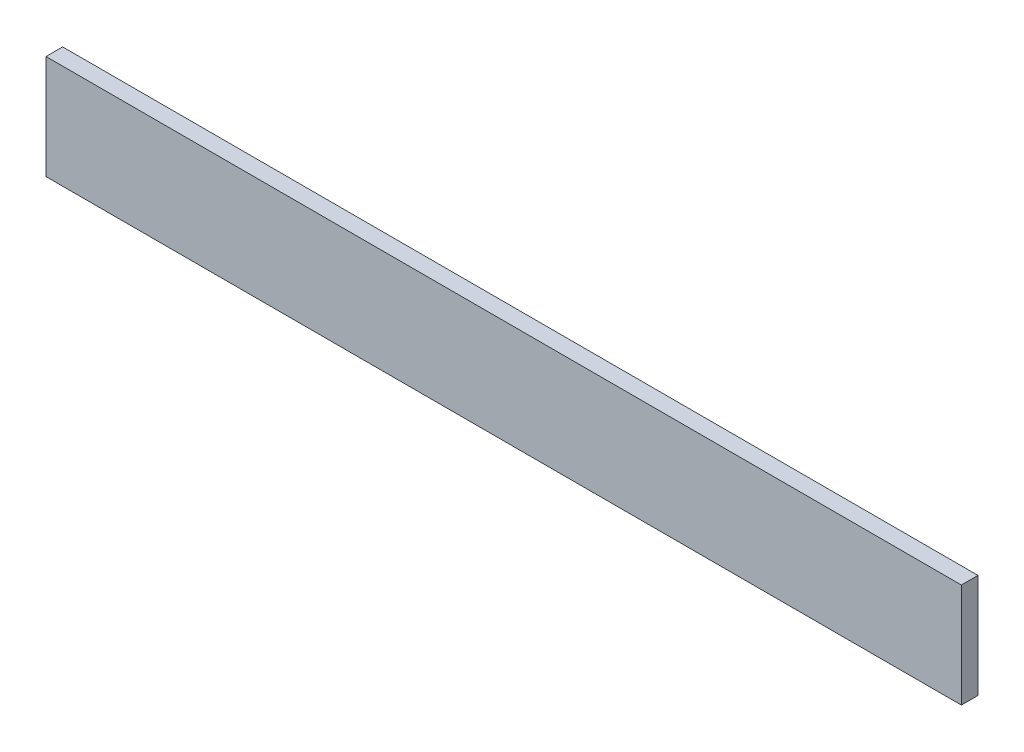
ISO-10303-21;
HEADER;
FILE_DESCRIPTION(('STEP AP214'),'2;1');
FILE_NAME('part.step','',(''),(''),'','','');
FILE_SCHEMA(('AUTOMOTIVE_DESIGN { 1 0 10303 214 1 1 1 1 }'));
ENDSEC;
DATA;
#1=APPLICATION_CONTEXT('core data for automotive mechanical design processes');
#2=APPLICATION_PROTOCOL_DEFINITION('international standard','automotive_design',2000,#1);
#3=PRODUCT_CONTEXT('',#1,'mechanical');
#4=PRODUCT('Part','Part','',(#3));
#5=PRODUCT_RELATED_PRODUCT_CATEGORY('part','',(#4));
#6=PRODUCT_DEFINITION_FORMATION('','',#4);
#7=PRODUCT_DEFINITION_CONTEXT('part definition',#1,'design');
#8=PRODUCT_DEFINITION('design','',#6,#7);
#9=PRODUCT_DEFINITION_SHAPE('','',#8);
#10=(LENGTH_UNIT() NAMED_UNIT(*) SI_UNIT(.MILLI.,.METRE.));
#11=(NAMED_UNIT(*) PLANE_ANGLE_UNIT() SI_UNIT($,.RADIAN.));
#12=(NAMED_UNIT(*) SI_UNIT($,.STERADIAN.) SOLID_ANGLE_UNIT());
#13=UNCERTAINTY_MEASURE_WITH_UNIT(LENGTH_MEASURE(1.E-05),#10,'distance_accuracy_value','');
#14=(GEOMETRIC_REPRESENTATION_CONTEXT(3) GLOBAL_UNCERTAINTY_ASSIGNED_CONTEXT((#13)) GLOBAL_UNIT_ASSIGNED_CONTEXT((#10,
#11,#12)) REPRESENTATION_CONTEXT('',''));
#15=CARTESIAN_POINT('',(0.,0.,0.));
#16=DIRECTION('',(0.,0.,1.));
#17=DIRECTION('',(1.,0.,0.));
#18=AXIS2_PLACEMENT_3D('',#15,#16,#17);
#19=CARTESIAN_POINT('',(-110.913276477447,31.0383208470739,4.));
#20=DIRECTION('',(1.,0.,0.));
#21=DIRECTION('',(0.,0.,-1.));
#22=AXIS2_PLACEMENT_3D('',#19,#20,#21);
#23=PLANE('',#22);
#24=DIRECTION('',(0.,-1.,0.));
#25=VECTOR('',#24,1.);
#26=CARTESIAN_POINT('',(-110.913276477447,31.0383208470739,0.));
#27=LINE('',#26,#25);
#28=CARTESIAN_POINT('',(-110.913276477447,31.0383208470739,0.));
#29=VERTEX_POINT('',#28);
#30=CARTESIAN_POINT('',(-110.913276477447,6.03832084707392,0.));
#31=VERTEX_POINT('',#30);
#32=EDGE_CURVE('E96',#29,#31,#27,.T.);
#33=ORIENTED_EDGE('',*,*,#32,.T.);
#34=DIRECTION('',(0.,0.,-1.));
#35=VECTOR('',#34,1.);
#36=CARTESIAN_POINT('',(-110.913276477447,6.03832084707392,4.));
#37=LINE('',#36,#35);
#38=CARTESIAN_POINT('',(-110.913276477447,6.03832084707392,4.));
#39=VERTEX_POINT('',#38);
#40=EDGE_CURVE('E11',#39,#31,#37,.T.);
#41=ORIENTED_EDGE('',*,*,#40,.F.);
#42=DIRECTION('',(0.,-1.,0.));
#43=VECTOR('',#42,1.);
#44=CARTESIAN_POINT('',(-110.913276477447,31.0383208470739,4.));
#45=LINE('',#44,#43);
#46=CARTESIAN_POINT('',(-110.913276477447,31.0383208470739,4.));
#47=VERTEX_POINT('',#46);
#48=EDGE_CURVE('E84',#47,#39,#45,.T.);
#49=ORIENTED_EDGE('',*,*,#48,.F.);
#50=DIRECTION('',(0.,0.,-1.));
#51=VECTOR('',#50,1.);
#52=CARTESIAN_POINT('',(-110.913276477447,31.0383208470739,4.));
#53=LINE('',#52,#51);
#54=EDGE_CURVE('E92',#47,#29,#53,.T.);
#55=ORIENTED_EDGE('',*,*,#54,.T.);
#56=EDGE_LOOP('',(#33,#41,#49,#55));
#57=FACE_BOUND('',#56,.T.);
#58=ADVANCED_FACE('F33',(#57),#23,.F.);
#59=CARTESIAN_POINT('',(-110.913276477447,6.03832084707392,4.));
#60=DIRECTION('',(0.,1.,0.));
#61=DIRECTION('',(0.,0.,1.));
#62=AXIS2_PLACEMENT_3D('',#59,#60,#61);
#63=PLANE('',#62);
#64=DIRECTION('',(1.,0.,0.));
#65=VECTOR('',#64,1.);
#66=CARTESIAN_POINT('',(-110.913276477447,6.03832084707392,0.));
#67=LINE('',#66,#65);
#68=CARTESIAN_POINT('',(109.086723522553,6.03832084707392,0.));
#69=VERTEX_POINT('',#68);
#70=EDGE_CURVE('E88',#31,#69,#67,.T.);
#71=ORIENTED_EDGE('',*,*,#70,.T.);
#72=DIRECTION('',(0.,0.,-1.));
#73=VECTOR('',#72,1.);
#74=CARTESIAN_POINT('',(109.086723522553,6.03832084707392,4.));
#75=LINE('',#74,#73);
#76=CARTESIAN_POINT('',(109.086723522553,6.03832084707392,4.));
#77=VERTEX_POINT('',#76);
#78=EDGE_CURVE('E41',#77,#69,#75,.T.);
#79=ORIENTED_EDGE('',*,*,#78,.F.);
#80=DIRECTION('',(1.,0.,0.));
#81=VECTOR('',#80,1.);
#82=CARTESIAN_POINT('',(-110.913276477447,6.03832084707392,4.));
#83=LINE('',#82,#81);
#84=EDGE_CURVE('E79',#39,#77,#83,.T.);
#85=ORIENTED_EDGE('',*,*,#84,.F.);
#86=ORIENTED_EDGE('',*,*,#40,.T.);
#87=EDGE_LOOP('',(#71,#79,#85,#86));
#88=FACE_BOUND('',#87,.T.);
#89=ADVANCED_FACE('F87',(#88),#63,.F.);
#90=CARTESIAN_POINT('',(109.086723522553,31.0383208470739,4.));
#91=DIRECTION('',(-1.,0.,0.));
#92=DIRECTION('',(0.,0.,1.));
#93=AXIS2_PLACEMENT_3D('',#90,#91,#92);
#94=PLANE('',#93);
#95=DIRECTION('',(0.,1.,0.));
#96=VECTOR('',#95,1.);
#97=CARTESIAN_POINT('',(109.086723522553,31.0383208470739,0.));
#98=LINE('',#97,#96);
#99=CARTESIAN_POINT('',(109.086723522553,31.0383208470739,0.));
#100=VERTEX_POINT('',#99);
#101=EDGE_CURVE('E66',#69,#100,#98,.T.);
#102=ORIENTED_EDGE('',*,*,#101,.T.);
#103=DIRECTION('',(0.,0.,-1.));
#104=VECTOR('',#103,1.);
#105=CARTESIAN_POINT('',(109.086723522553,31.0383208470739,4.));
#106=LINE('',#105,#104);
#107=CARTESIAN_POINT('',(109.086723522553,31.0383208470739,4.));
#108=VERTEX_POINT('',#107);
#109=EDGE_CURVE('E89',#108,#100,#106,.T.);
#110=ORIENTED_EDGE('',*,*,#109,.F.);
#111=DIRECTION('',(0.,1.,0.));
#112=VECTOR('',#111,1.);
#113=CARTESIAN_POINT('',(109.086723522553,31.0383208470739,4.));
#114=LINE('',#113,#112);
#115=EDGE_CURVE('E82',#77,#108,#114,.T.);
#116=ORIENTED_EDGE('',*,*,#115,.F.);
#117=ORIENTED_EDGE('',*,*,#78,.T.);
#118=EDGE_LOOP('',(#102,#110,#116,#117));
#119=FACE_BOUND('',#118,.T.);
#120=ADVANCED_FACE('F90',(#119),#94,.F.);
#121=CARTESIAN_POINT('',(-110.913276477447,31.0383208470739,4.));
#122=DIRECTION('',(0.,-1.,0.));
#123=DIRECTION('',(0.,0.,-1.));
#124=AXIS2_PLACEMENT_3D('',#121,#122,#123);
#125=PLANE('',#124);
#126=DIRECTION('',(-1.,0.,0.));
#127=VECTOR('',#126,1.);
#128=CARTESIAN_POINT('',(-110.913276477447,31.0383208470739,0.));
#129=LINE('',#128,#127);
#130=EDGE_CURVE('E72',#100,#29,#129,.T.);
#131=ORIENTED_EDGE('',*,*,#130,.T.);
#132=ORIENTED_EDGE('',*,*,#54,.F.);
#133=DIRECTION('',(-1.,0.,0.));
#134=VECTOR('',#133,1.);
#135=CARTESIAN_POINT('',(-110.913276477447,31.0383208470739,4.));
#136=LINE('',#135,#134);
#137=EDGE_CURVE('E49',#108,#47,#136,.T.);
#138=ORIENTED_EDGE('',*,*,#137,.F.);
#139=ORIENTED_EDGE('',*,*,#109,.T.);
#140=EDGE_LOOP('',(#131,#132,#138,#139));
#141=FACE_BOUND('',#140,.T.);
#142=ADVANCED_FACE('F103',(#141),#125,.F.);
#143=CARTESIAN_POINT('',(-110.913276477447,6.03832084707392,4.));
#144=DIRECTION('',(0.,0.,1.));
#145=DIRECTION('',(1.,0.,0.));
#146=AXIS2_PLACEMENT_3D('',#143,#144,#145);
#147=PLANE('',#146);
#148=ORIENTED_EDGE('',*,*,#48,.T.);
#149=ORIENTED_EDGE('',*,*,#84,.T.);
#150=ORIENTED_EDGE('',*,*,#115,.T.);
#151=ORIENTED_EDGE('',*,*,#137,.T.);
#152=EDGE_LOOP('',(#148,#149,#150,#151));
#153=FACE_BOUND('',#152,.T.);
#154=ADVANCED_FACE('F80',(#153),#147,.T.);
#155=CARTESIAN_POINT('',(-110.913276477447,6.03832084707392,0.));
#156=DIRECTION('',(0.,0.,1.));
#157=DIRECTION('',(1.,0.,0.));
#158=AXIS2_PLACEMENT_3D('',#155,#156,#157);
#159=PLANE('',#158);
#160=ORIENTED_EDGE('',*,*,#32,.F.);
#161=ORIENTED_EDGE('',*,*,#130,.F.);
#162=ORIENTED_EDGE('',*,*,#101,.F.);
#163=ORIENTED_EDGE('',*,*,#70,.F.);
#164=EDGE_LOOP('',(#160,#161,#162,#163));
#165=FACE_BOUND('',#164,.T.);
#166=ADVANCED_FACE('F106',(#165),#159,.F.);
#167=CLOSED_SHELL('',(#58,#89,#120,#142,#154,#166));
#168=MANIFOLD_SOLID_BREP('B2',#167);
#169=ADVANCED_BREP_SHAPE_REPRESENTATION('',(#18,#168),#14);
#170=SHAPE_DEFINITION_REPRESENTATION(#9,#169);
ENDSEC;
END-ISO-10303-21;
